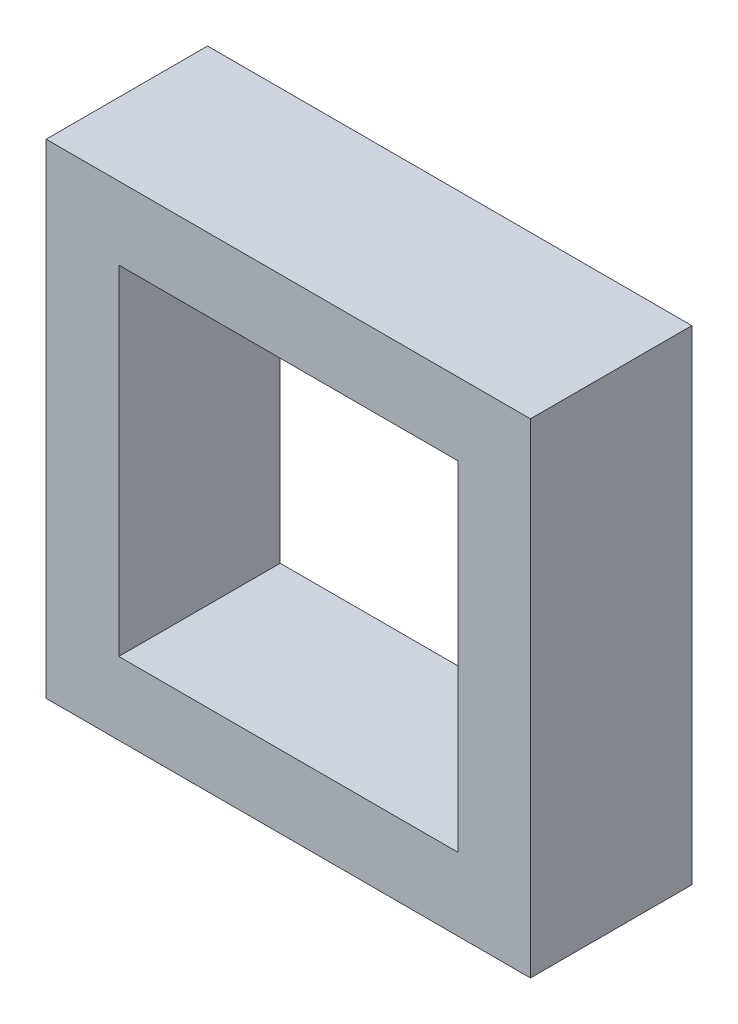
ISO-10303-21;
HEADER;
FILE_DESCRIPTION(('STEP AP214'),'2;1');
FILE_NAME('part.step','',(''),(''),'','','');
FILE_SCHEMA(('AUTOMOTIVE_DESIGN { 1 0 10303 214 1 1 1 1 }'));
ENDSEC;
DATA;
#1=APPLICATION_CONTEXT('core data for automotive mechanical design processes');
#2=APPLICATION_PROTOCOL_DEFINITION('international standard','automotive_design',2000,#1);
#3=PRODUCT_CONTEXT('',#1,'mechanical');
#4=PRODUCT('Part','Part','',(#3));
#5=PRODUCT_RELATED_PRODUCT_CATEGORY('part','',(#4));
#6=PRODUCT_DEFINITION_FORMATION('','',#4);
#7=PRODUCT_DEFINITION_CONTEXT('part definition',#1,'design');
#8=PRODUCT_DEFINITION('design','',#6,#7);
#9=PRODUCT_DEFINITION_SHAPE('','',#8);
#10=(LENGTH_UNIT() NAMED_UNIT(*) SI_UNIT(.MILLI.,.METRE.));
#11=(NAMED_UNIT(*) PLANE_ANGLE_UNIT() SI_UNIT($,.RADIAN.));
#12=(NAMED_UNIT(*) SI_UNIT($,.STERADIAN.) SOLID_ANGLE_UNIT());
#13=UNCERTAINTY_MEASURE_WITH_UNIT(LENGTH_MEASURE(1.E-05),#10,'distance_accuracy_value','');
#14=(GEOMETRIC_REPRESENTATION_CONTEXT(3) GLOBAL_UNCERTAINTY_ASSIGNED_CONTEXT((#13)) GLOBAL_UNIT_ASSIGNED_CONTEXT((#10,
#11,#12)) REPRESENTATION_CONTEXT('',''));
#15=CARTESIAN_POINT('',(0.,0.,0.));
#16=DIRECTION('',(0.,0.,1.));
#17=DIRECTION('',(1.,0.,0.));
#18=AXIS2_PLACEMENT_3D('',#15,#16,#17);
#19=CARTESIAN_POINT('',(0.,0.,2.));
#20=DIRECTION('',(0.,0.,-1.));
#21=DIRECTION('',(-1.,0.,0.));
#22=AXIS2_PLACEMENT_3D('',#19,#20,#21);
#23=PLANE('',#22);
#24=DIRECTION('',(0.,1.,0.));
#25=VECTOR('',#24,1.);
#26=CARTESIAN_POINT('',(5.1,5.1,2.));
#27=LINE('',#26,#25);
#28=CARTESIAN_POINT('',(5.1,-0.9,2.));
#29=VERTEX_POINT('',#28);
#30=CARTESIAN_POINT('',(5.1,5.1,2.));
#31=VERTEX_POINT('',#30);
#32=EDGE_CURVE('E136',#29,#31,#27,.T.);
#33=ORIENTED_EDGE('',*,*,#32,.T.);
#34=DIRECTION('',(-1.,0.,0.));
#35=VECTOR('',#34,1.);
#36=CARTESIAN_POINT('',(5.1,5.1,2.));
#37=LINE('',#36,#35);
#38=CARTESIAN_POINT('',(-0.9,5.1,2.));
#39=VERTEX_POINT('',#38);
#40=EDGE_CURVE('E139',#31,#39,#37,.T.);
#41=ORIENTED_EDGE('',*,*,#40,.T.);
#42=DIRECTION('',(0.,-1.,0.));
#43=VECTOR('',#42,1.);
#44=CARTESIAN_POINT('',(-0.9,5.1,2.));
#45=LINE('',#44,#43);
#46=CARTESIAN_POINT('',(-0.900000000000001,-0.9,2.));
#47=VERTEX_POINT('',#46);
#48=EDGE_CURVE('E142',#39,#47,#45,.T.);
#49=ORIENTED_EDGE('',*,*,#48,.T.);
#50=DIRECTION('',(1.,0.,0.));
#51=VECTOR('',#50,1.);
#52=CARTESIAN_POINT('',(5.1,-0.9,2.));
#53=LINE('',#52,#51);
#54=EDGE_CURVE('E144',#47,#29,#53,.T.);
#55=ORIENTED_EDGE('',*,*,#54,.T.);
#56=EDGE_LOOP('',(#33,#41,#49,#55));
#57=FACE_BOUND('',#56,.T.);
#58=DIRECTION('',(0.,-1.,0.));
#59=VECTOR('',#58,1.);
#60=CARTESIAN_POINT('',(0.,0.,2.));
#61=LINE('',#60,#59);
#62=CARTESIAN_POINT('',(0.,4.2,2.));
#63=VERTEX_POINT('',#62);
#64=CARTESIAN_POINT('',(0.,0.,2.));
#65=VERTEX_POINT('',#64);
#66=EDGE_CURVE('E100',#63,#65,#61,.T.);
#67=ORIENTED_EDGE('',*,*,#66,.F.);
#68=DIRECTION('',(-1.,0.,0.));
#69=VECTOR('',#68,1.);
#70=CARTESIAN_POINT('',(0.,4.2,2.));
#71=LINE('',#70,#69);
#72=CARTESIAN_POINT('',(4.2,4.2,2.));
#73=VERTEX_POINT('',#72);
#74=EDGE_CURVE('E122',#73,#63,#71,.T.);
#75=ORIENTED_EDGE('',*,*,#74,.F.);
#76=DIRECTION('',(0.,1.,0.));
#77=VECTOR('',#76,1.);
#78=CARTESIAN_POINT('',(4.2,0.,2.));
#79=LINE('',#78,#77);
#80=CARTESIAN_POINT('',(4.2,0.,2.));
#81=VERTEX_POINT('',#80);
#82=EDGE_CURVE('E120',#81,#73,#79,.T.);
#83=ORIENTED_EDGE('',*,*,#82,.F.);
#84=DIRECTION('',(1.,0.,0.));
#85=VECTOR('',#84,1.);
#86=CARTESIAN_POINT('',(0.,0.,2.));
#87=LINE('',#86,#85);
#88=EDGE_CURVE('E108',#65,#81,#87,.T.);
#89=ORIENTED_EDGE('',*,*,#88,.F.);
#90=EDGE_LOOP('',(#67,#75,#83,#89));
#91=FACE_BOUND('',#90,.T.);
#92=ADVANCED_FACE('F35',(#57,#91),#23,.F.);
#93=CARTESIAN_POINT('',(0.,0.,0.));
#94=DIRECTION('',(0.,0.,-1.));
#95=DIRECTION('',(-1.,0.,0.));
#96=AXIS2_PLACEMENT_3D('',#93,#94,#95);
#97=PLANE('',#96);
#98=DIRECTION('',(0.,1.,0.));
#99=VECTOR('',#98,1.);
#100=CARTESIAN_POINT('',(5.1,5.1,0.));
#101=LINE('',#100,#99);
#102=CARTESIAN_POINT('',(5.1,-0.9,0.));
#103=VERTEX_POINT('',#102);
#104=CARTESIAN_POINT('',(5.1,5.1,0.));
#105=VERTEX_POINT('',#104);
#106=EDGE_CURVE('E116',#103,#105,#101,.T.);
#107=ORIENTED_EDGE('',*,*,#106,.F.);
#108=DIRECTION('',(1.,0.,0.));
#109=VECTOR('',#108,1.);
#110=CARTESIAN_POINT('',(5.1,-0.9,0.));
#111=LINE('',#110,#109);
#112=CARTESIAN_POINT('',(-0.900000000000001,-0.9,0.));
#113=VERTEX_POINT('',#112);
#114=EDGE_CURVE('E140',#113,#103,#111,.T.);
#115=ORIENTED_EDGE('',*,*,#114,.F.);
#116=DIRECTION('',(0.,-1.,0.));
#117=VECTOR('',#116,1.);
#118=CARTESIAN_POINT('',(-0.9,5.1,0.));
#119=LINE('',#118,#117);
#120=CARTESIAN_POINT('',(-0.9,5.1,0.));
#121=VERTEX_POINT('',#120);
#122=EDGE_CURVE('E151',#121,#113,#119,.T.);
#123=ORIENTED_EDGE('',*,*,#122,.F.);
#124=DIRECTION('',(-1.,0.,0.));
#125=VECTOR('',#124,1.);
#126=CARTESIAN_POINT('',(5.1,5.1,0.));
#127=LINE('',#126,#125);
#128=EDGE_CURVE('E149',#105,#121,#127,.T.);
#129=ORIENTED_EDGE('',*,*,#128,.F.);
#130=EDGE_LOOP('',(#107,#115,#123,#129));
#131=FACE_BOUND('',#130,.T.);
#132=DIRECTION('',(-1.,0.,0.));
#133=VECTOR('',#132,1.);
#134=CARTESIAN_POINT('',(0.,4.2,0.));
#135=LINE('',#134,#133);
#136=CARTESIAN_POINT('',(4.2,4.2,0.));
#137=VERTEX_POINT('',#136);
#138=CARTESIAN_POINT('',(0.,4.2,0.));
#139=VERTEX_POINT('',#138);
#140=EDGE_CURVE('E109',#137,#139,#135,.T.);
#141=ORIENTED_EDGE('',*,*,#140,.T.);
#142=DIRECTION('',(0.,-1.,0.));
#143=VECTOR('',#142,1.);
#144=CARTESIAN_POINT('',(0.,0.,0.));
#145=LINE('',#144,#143);
#146=CARTESIAN_POINT('',(0.,0.,0.));
#147=VERTEX_POINT('',#146);
#148=EDGE_CURVE('E58',#139,#147,#145,.T.);
#149=ORIENTED_EDGE('',*,*,#148,.T.);
#150=DIRECTION('',(1.,0.,0.));
#151=VECTOR('',#150,1.);
#152=CARTESIAN_POINT('',(0.,0.,0.));
#153=LINE('',#152,#151);
#154=CARTESIAN_POINT('',(4.2,0.,0.));
#155=VERTEX_POINT('',#154);
#156=EDGE_CURVE('E115',#147,#155,#153,.T.);
#157=ORIENTED_EDGE('',*,*,#156,.T.);
#158=DIRECTION('',(0.,1.,0.));
#159=VECTOR('',#158,1.);
#160=CARTESIAN_POINT('',(4.2,0.,0.));
#161=LINE('',#160,#159);
#162=EDGE_CURVE('E128',#155,#137,#161,.T.);
#163=ORIENTED_EDGE('',*,*,#162,.T.);
#164=EDGE_LOOP('',(#141,#149,#157,#163));
#165=FACE_BOUND('',#164,.T.);
#166=ADVANCED_FACE('F169',(#131,#165),#97,.T.);
#167=CARTESIAN_POINT('',(5.1,5.1,2.));
#168=DIRECTION('',(-1.,0.,0.));
#169=DIRECTION('',(0.,-1.,0.));
#170=AXIS2_PLACEMENT_3D('',#167,#168,#169);
#171=PLANE('',#170);
#172=ORIENTED_EDGE('',*,*,#106,.T.);
#173=DIRECTION('',(0.,0.,-1.));
#174=VECTOR('',#173,1.);
#175=CARTESIAN_POINT('',(5.1,5.1,2.));
#176=LINE('',#175,#174);
#177=EDGE_CURVE('E11',#31,#105,#176,.T.);
#178=ORIENTED_EDGE('',*,*,#177,.F.);
#179=ORIENTED_EDGE('',*,*,#32,.F.);
#180=DIRECTION('',(0.,0.,-1.));
#181=VECTOR('',#180,1.);
#182=CARTESIAN_POINT('',(5.1,-0.9,2.));
#183=LINE('',#182,#181);
#184=EDGE_CURVE('E146',#29,#103,#183,.T.);
#185=ORIENTED_EDGE('',*,*,#184,.T.);
#186=EDGE_LOOP('',(#172,#178,#179,#185));
#187=FACE_BOUND('',#186,.T.);
#188=ADVANCED_FACE('F37',(#187),#171,.F.);
#189=CARTESIAN_POINT('',(5.1,5.1,2.));
#190=DIRECTION('',(0.,-1.,0.));
#191=DIRECTION('',(0.,0.,-1.));
#192=AXIS2_PLACEMENT_3D('',#189,#190,#191);
#193=PLANE('',#192);
#194=ORIENTED_EDGE('',*,*,#128,.T.);
#195=DIRECTION('',(0.,0.,-1.));
#196=VECTOR('',#195,1.);
#197=CARTESIAN_POINT('',(-0.9,5.1,2.));
#198=LINE('',#197,#196);
#199=EDGE_CURVE('E43',#39,#121,#198,.T.);
#200=ORIENTED_EDGE('',*,*,#199,.F.);
#201=ORIENTED_EDGE('',*,*,#40,.F.);
#202=ORIENTED_EDGE('',*,*,#177,.T.);
#203=EDGE_LOOP('',(#194,#200,#201,#202));
#204=FACE_BOUND('',#203,.T.);
#205=ADVANCED_FACE('F179',(#204),#193,.F.);
#206=CARTESIAN_POINT('',(-0.9,5.1,2.));
#207=DIRECTION('',(1.,0.,0.));
#208=DIRECTION('',(0.,1.,0.));
#209=AXIS2_PLACEMENT_3D('',#206,#207,#208);
#210=PLANE('',#209);
#211=ORIENTED_EDGE('',*,*,#122,.T.);
#212=DIRECTION('',(0.,0.,-1.));
#213=VECTOR('',#212,1.);
#214=CARTESIAN_POINT('',(-0.900000000000001,-0.9,2.));
#215=LINE('',#214,#213);
#216=EDGE_CURVE('E156',#47,#113,#215,.T.);
#217=ORIENTED_EDGE('',*,*,#216,.F.);
#218=ORIENTED_EDGE('',*,*,#48,.F.);
#219=ORIENTED_EDGE('',*,*,#199,.T.);
#220=EDGE_LOOP('',(#211,#217,#218,#219));
#221=FACE_BOUND('',#220,.T.);
#222=ADVANCED_FACE('F163',(#221),#210,.F.);
#223=CARTESIAN_POINT('',(5.1,-0.9,2.));
#224=DIRECTION('',(0.,1.,0.));
#225=DIRECTION('',(0.,0.,1.));
#226=AXIS2_PLACEMENT_3D('',#223,#224,#225);
#227=PLANE('',#226);
#228=ORIENTED_EDGE('',*,*,#114,.T.);
#229=ORIENTED_EDGE('',*,*,#184,.F.);
#230=ORIENTED_EDGE('',*,*,#54,.F.);
#231=ORIENTED_EDGE('',*,*,#216,.T.);
#232=EDGE_LOOP('',(#228,#229,#230,#231));
#233=FACE_BOUND('',#232,.T.);
#234=ADVANCED_FACE('F173',(#233),#227,.F.);
#235=CARTESIAN_POINT('',(0.,0.,2.));
#236=DIRECTION('',(1.,0.,0.));
#237=DIRECTION('',(0.,0.,-1.));
#238=AXIS2_PLACEMENT_3D('',#235,#236,#237);
#239=PLANE('',#238);
#240=ORIENTED_EDGE('',*,*,#148,.F.);
#241=DIRECTION('',(0.,0.,-1.));
#242=VECTOR('',#241,1.);
#243=CARTESIAN_POINT('',(0.,4.2,2.));
#244=LINE('',#243,#242);
#245=EDGE_CURVE('E104',#63,#139,#244,.T.);
#246=ORIENTED_EDGE('',*,*,#245,.F.);
#247=ORIENTED_EDGE('',*,*,#66,.T.);
#248=DIRECTION('',(0.,0.,-1.));
#249=VECTOR('',#248,1.);
#250=CARTESIAN_POINT('',(0.,0.,2.));
#251=LINE('',#250,#249);
#252=EDGE_CURVE('E103',#65,#147,#251,.T.);
#253=ORIENTED_EDGE('',*,*,#252,.T.);
#254=EDGE_LOOP('',(#240,#246,#247,#253));
#255=FACE_BOUND('',#254,.T.);
#256=ADVANCED_FACE('F102',(#255),#239,.T.);
#257=CARTESIAN_POINT('',(0.,0.,2.));
#258=DIRECTION('',(0.,1.,0.));
#259=DIRECTION('',(0.,0.,1.));
#260=AXIS2_PLACEMENT_3D('',#257,#258,#259);
#261=PLANE('',#260);
#262=ORIENTED_EDGE('',*,*,#156,.F.);
#263=ORIENTED_EDGE('',*,*,#252,.F.);
#264=ORIENTED_EDGE('',*,*,#88,.T.);
#265=DIRECTION('',(0.,0.,-1.));
#266=VECTOR('',#265,1.);
#267=CARTESIAN_POINT('',(4.2,0.,2.));
#268=LINE('',#267,#266);
#269=EDGE_CURVE('E117',#81,#155,#268,.T.);
#270=ORIENTED_EDGE('',*,*,#269,.T.);
#271=EDGE_LOOP('',(#262,#263,#264,#270));
#272=FACE_BOUND('',#271,.T.);
#273=ADVANCED_FACE('F112',(#272),#261,.T.);
#274=CARTESIAN_POINT('',(4.2,0.,2.));
#275=DIRECTION('',(-1.,0.,0.));
#276=DIRECTION('',(0.,0.,1.));
#277=AXIS2_PLACEMENT_3D('',#274,#275,#276);
#278=PLANE('',#277);
#279=ORIENTED_EDGE('',*,*,#162,.F.);
#280=ORIENTED_EDGE('',*,*,#269,.F.);
#281=ORIENTED_EDGE('',*,*,#82,.T.);
#282=DIRECTION('',(0.,0.,-1.));
#283=VECTOR('',#282,1.);
#284=CARTESIAN_POINT('',(4.2,4.2,2.));
#285=LINE('',#284,#283);
#286=EDGE_CURVE('E50',#73,#137,#285,.T.);
#287=ORIENTED_EDGE('',*,*,#286,.T.);
#288=EDGE_LOOP('',(#279,#280,#281,#287));
#289=FACE_BOUND('',#288,.T.);
#290=ADVANCED_FACE('F202',(#289),#278,.T.);
#291=CARTESIAN_POINT('',(0.,4.2,2.));
#292=DIRECTION('',(0.,-1.,0.));
#293=DIRECTION('',(0.,0.,-1.));
#294=AXIS2_PLACEMENT_3D('',#291,#292,#293);
#295=PLANE('',#294);
#296=ORIENTED_EDGE('',*,*,#140,.F.);
#297=ORIENTED_EDGE('',*,*,#286,.F.);
#298=ORIENTED_EDGE('',*,*,#74,.T.);
#299=ORIENTED_EDGE('',*,*,#245,.T.);
#300=EDGE_LOOP('',(#296,#297,#298,#299));
#301=FACE_BOUND('',#300,.T.);
#302=ADVANCED_FACE('F206',(#301),#295,.T.);
#303=CLOSED_SHELL('',(#92,#166,#188,#205,#222,#234,#256,#273,#290,#302));
#304=MANIFOLD_SOLID_BREP('B2',#303);
#305=ADVANCED_BREP_SHAPE_REPRESENTATION('',(#18,#304),#14);
#306=SHAPE_DEFINITION_REPRESENTATION(#9,#305);
ENDSEC;
END-ISO-10303-21;
